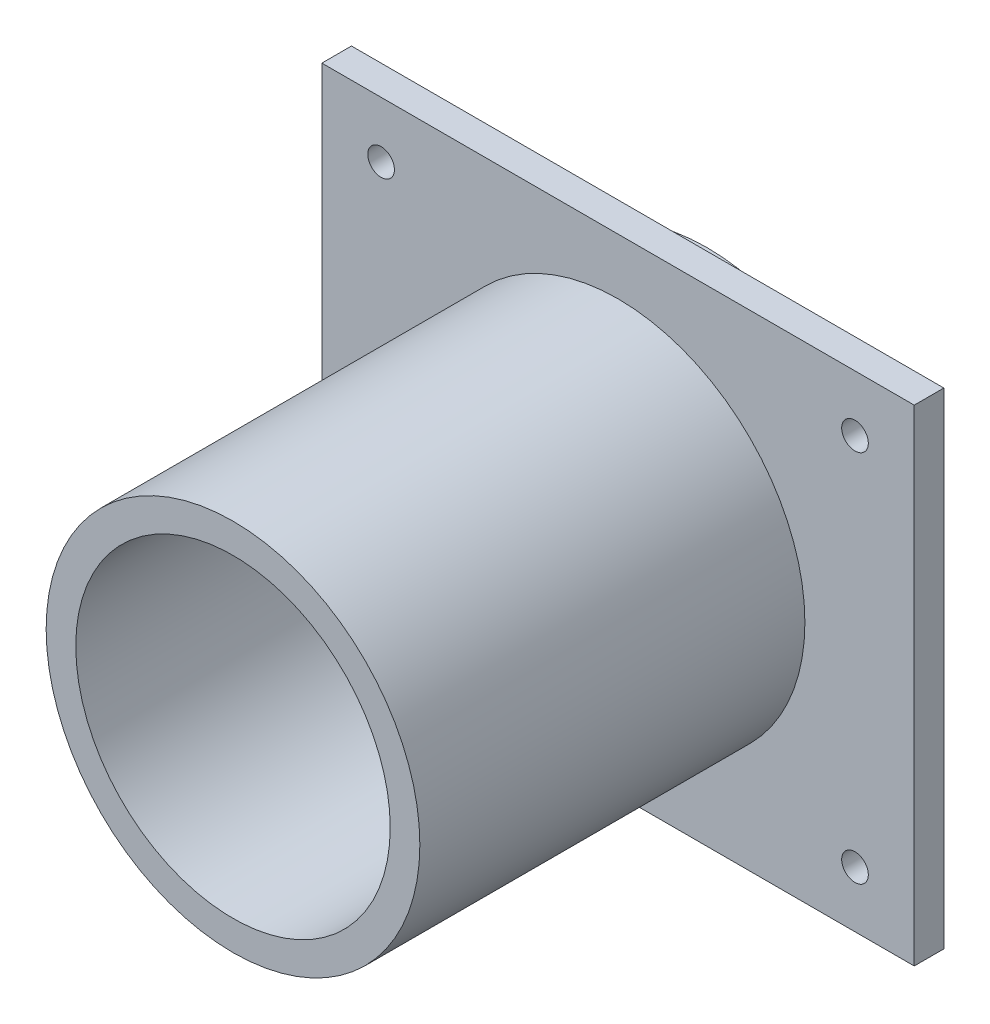
ISO-10303-21;
HEADER;
FILE_DESCRIPTION(('STEP AP214'),'2;1');
FILE_NAME('part.step','',(''),(''),'','','');
FILE_SCHEMA(('AUTOMOTIVE_DESIGN { 1 0 10303 214 1 1 1 1 }'));
ENDSEC;
DATA;
#1=APPLICATION_CONTEXT('core data for automotive mechanical design processes');
#2=APPLICATION_PROTOCOL_DEFINITION('international standard','automotive_design',2000,#1);
#3=PRODUCT_CONTEXT('',#1,'mechanical');
#4=PRODUCT('Part','Part','',(#3));
#5=PRODUCT_RELATED_PRODUCT_CATEGORY('part','',(#4));
#6=PRODUCT_DEFINITION_FORMATION('','',#4);
#7=PRODUCT_DEFINITION_CONTEXT('part definition',#1,'design');
#8=PRODUCT_DEFINITION('design','',#6,#7);
#9=PRODUCT_DEFINITION_SHAPE('','',#8);
#10=(LENGTH_UNIT() NAMED_UNIT(*) SI_UNIT(.MILLI.,.METRE.));
#11=(NAMED_UNIT(*) PLANE_ANGLE_UNIT() SI_UNIT($,.RADIAN.));
#12=(NAMED_UNIT(*) SI_UNIT($,.STERADIAN.) SOLID_ANGLE_UNIT());
#13=UNCERTAINTY_MEASURE_WITH_UNIT(LENGTH_MEASURE(1.E-05),#10,'distance_accuracy_value','');
#14=(GEOMETRIC_REPRESENTATION_CONTEXT(3) GLOBAL_UNCERTAINTY_ASSIGNED_CONTEXT((#13)) GLOBAL_UNIT_ASSIGNED_CONTEXT((#10,
#11,#12)) REPRESENTATION_CONTEXT('',''));
#15=CARTESIAN_POINT('',(0.,0.,0.));
#16=DIRECTION('',(0.,0.,1.));
#17=DIRECTION('',(1.,0.,0.));
#18=AXIS2_PLACEMENT_3D('',#15,#16,#17);
#19=CARTESIAN_POINT('',(0.,0.,-10.));
#20=DIRECTION('',(0.,0.,1.));
#21=DIRECTION('',(1.,0.,0.));
#22=AXIS2_PLACEMENT_3D('',#19,#20,#21);
#23=CYLINDRICAL_SURFACE('',#22,31.543);
#24=CARTESIAN_POINT('',(0.,0.,-10.));
#25=DIRECTION('',(0.,0.,1.));
#26=DIRECTION('',(1.,0.,0.));
#27=AXIS2_PLACEMENT_3D('',#24,#25,#26);
#28=CIRCLE('',#27,31.543);
#29=CARTESIAN_POINT('',(31.543,0.,-10.));
#30=VERTEX_POINT('',#29);
#31=EDGE_CURVE('E48',#30,#30,#28,.T.);
#32=ORIENTED_EDGE('',*,*,#31,.T.);
#33=EDGE_LOOP('',(#32));
#34=FACE_BOUND('',#33,.T.);
#35=CARTESIAN_POINT('',(0.,0.,0.));
#36=DIRECTION('',(0.,0.,1.));
#37=DIRECTION('',(1.,0.,0.));
#38=AXIS2_PLACEMENT_3D('',#35,#36,#37);
#39=CIRCLE('',#38,31.543);
#40=CARTESIAN_POINT('',(31.543,0.,0.));
#41=VERTEX_POINT('',#40);
#42=EDGE_CURVE('E133',#41,#41,#39,.T.);
#43=ORIENTED_EDGE('',*,*,#42,.F.);
#44=EDGE_LOOP('',(#43));
#45=FACE_BOUND('',#44,.T.);
#46=ADVANCED_FACE('F39',(#34,#45),#23,.T.);
#47=CARTESIAN_POINT('',(0.,0.,-10.));
#48=DIRECTION('',(0.,0.,1.));
#49=DIRECTION('',(1.,0.,0.));
#50=AXIS2_PLACEMENT_3D('',#47,#48,#49);
#51=PLANE('',#50);
#52=CARTESIAN_POINT('',(0.,0.,-10.));
#53=DIRECTION('',(0.,0.,1.));
#54=DIRECTION('',(1.,0.,0.));
#55=AXIS2_PLACEMENT_3D('',#52,#53,#54);
#56=CIRCLE('',#55,26.543);
#57=CARTESIAN_POINT('',(26.543,0.,-10.));
#58=VERTEX_POINT('',#57);
#59=EDGE_CURVE('E129',#58,#58,#56,.T.);
#60=ORIENTED_EDGE('',*,*,#59,.T.);
#61=EDGE_LOOP('',(#60));
#62=FACE_BOUND('',#61,.T.);
#63=ORIENTED_EDGE('',*,*,#31,.F.);
#64=EDGE_LOOP('',(#63));
#65=FACE_BOUND('',#64,.T.);
#66=ADVANCED_FACE('F147',(#62,#65),#51,.F.);
#67=CARTESIAN_POINT('',(0.,0.,-10.));
#68=DIRECTION('',(0.,0.,1.));
#69=DIRECTION('',(1.,0.,0.));
#70=AXIS2_PLACEMENT_3D('',#67,#68,#69);
#71=CYLINDRICAL_SURFACE('',#70,26.543);
#72=ORIENTED_EDGE('',*,*,#59,.F.);
#73=EDGE_LOOP('',(#72));
#74=FACE_BOUND('',#73,.T.);
#75=CARTESIAN_POINT('',(0.,0.,0.));
#76=DIRECTION('',(0.,0.,1.));
#77=DIRECTION('',(1.,0.,0.));
#78=AXIS2_PLACEMENT_3D('',#75,#76,#77);
#79=CIRCLE('',#78,26.543);
#80=CARTESIAN_POINT('',(26.543,0.,0.));
#81=VERTEX_POINT('',#80);
#82=EDGE_CURVE('E128',#81,#81,#79,.T.);
#83=ORIENTED_EDGE('',*,*,#82,.T.);
#84=EDGE_LOOP('',(#83));
#85=FACE_BOUND('',#84,.T.);
#86=ADVANCED_FACE('F152',(#74,#85),#71,.F.);
#87=CARTESIAN_POINT('',(0.,0.,0.));
#88=DIRECTION('',(0.,0.,-1.));
#89=DIRECTION('',(-1.,0.,0.));
#90=AXIS2_PLACEMENT_3D('',#87,#88,#89);
#91=PLANE('',#90);
#92=CARTESIAN_POINT('',(40.,31.543,0.));
#93=DIRECTION('',(0.,0.,-1.));
#94=DIRECTION('',(-1.,0.,0.));
#95=AXIS2_PLACEMENT_3D('',#92,#93,#94);
#96=CIRCLE('',#95,2.24999999999999);
#97=CARTESIAN_POINT('',(37.75,31.543,0.));
#98=VERTEX_POINT('',#97);
#99=EDGE_CURVE('E228',#98,#98,#96,.T.);
#100=ORIENTED_EDGE('',*,*,#99,.F.);
#101=EDGE_LOOP('',(#100));
#102=FACE_BOUND('',#101,.T.);
#103=CARTESIAN_POINT('',(-40.,31.543,0.));
#104=DIRECTION('',(0.,0.,-1.));
#105=DIRECTION('',(-1.,0.,0.));
#106=AXIS2_PLACEMENT_3D('',#103,#104,#105);
#107=CIRCLE('',#106,2.24999999999999);
#108=CARTESIAN_POINT('',(-42.25,31.543,0.));
#109=VERTEX_POINT('',#108);
#110=EDGE_CURVE('E236',#109,#109,#107,.T.);
#111=ORIENTED_EDGE('',*,*,#110,.F.);
#112=EDGE_LOOP('',(#111));
#113=FACE_BOUND('',#112,.T.);
#114=CARTESIAN_POINT('',(-40.,-31.543,0.));
#115=DIRECTION('',(0.,0.,-1.));
#116=DIRECTION('',(-1.,0.,0.));
#117=AXIS2_PLACEMENT_3D('',#114,#115,#116);
#118=CIRCLE('',#117,2.24999999999999);
#119=CARTESIAN_POINT('',(-42.25,-31.543,0.));
#120=VERTEX_POINT('',#119);
#121=EDGE_CURVE('E244',#120,#120,#118,.T.);
#122=ORIENTED_EDGE('',*,*,#121,.F.);
#123=EDGE_LOOP('',(#122));
#124=FACE_BOUND('',#123,.T.);
#125=CARTESIAN_POINT('',(40.,-31.543,0.));
#126=DIRECTION('',(0.,0.,-1.));
#127=DIRECTION('',(-1.,0.,0.));
#128=AXIS2_PLACEMENT_3D('',#125,#126,#127);
#129=CIRCLE('',#128,2.24999999999999);
#130=CARTESIAN_POINT('',(37.75,-31.543,0.));
#131=VERTEX_POINT('',#130);
#132=EDGE_CURVE('E252',#131,#131,#129,.T.);
#133=ORIENTED_EDGE('',*,*,#132,.F.);
#134=EDGE_LOOP('',(#133));
#135=FACE_BOUND('',#134,.T.);
#136=ORIENTED_EDGE('',*,*,#42,.T.);
#137=EDGE_LOOP('',(#136));
#138=FACE_BOUND('',#137,.T.);
#139=DIRECTION('',(0.,1.,0.));
#140=VECTOR('',#139,1.);
#141=CARTESIAN_POINT('',(50.,-41.,0.));
#142=LINE('',#141,#140);
#143=CARTESIAN_POINT('',(50.,-41.,0.));
#144=VERTEX_POINT('',#143);
#145=CARTESIAN_POINT('',(50.,41.,0.));
#146=VERTEX_POINT('',#145);
#147=EDGE_CURVE('E111',#144,#146,#142,.T.);
#148=ORIENTED_EDGE('',*,*,#147,.F.);
#149=DIRECTION('',(1.,0.,0.));
#150=VECTOR('',#149,1.);
#151=CARTESIAN_POINT('',(-50.,-41.,0.));
#152=LINE('',#151,#150);
#153=CARTESIAN_POINT('',(-50.,-41.,0.));
#154=VERTEX_POINT('',#153);
#155=EDGE_CURVE('E79',#154,#144,#152,.T.);
#156=ORIENTED_EDGE('',*,*,#155,.F.);
#157=DIRECTION('',(0.,-1.,0.));
#158=VECTOR('',#157,1.);
#159=CARTESIAN_POINT('',(-50.,-41.,0.));
#160=LINE('',#159,#158);
#161=CARTESIAN_POINT('',(-50.,41.,0.));
#162=VERTEX_POINT('',#161);
#163=EDGE_CURVE('E73',#162,#154,#160,.T.);
#164=ORIENTED_EDGE('',*,*,#163,.F.);
#165=DIRECTION('',(-1.,0.,0.));
#166=VECTOR('',#165,1.);
#167=CARTESIAN_POINT('',(-50.,41.,0.));
#168=LINE('',#167,#166);
#169=EDGE_CURVE('E98',#146,#162,#168,.T.);
#170=ORIENTED_EDGE('',*,*,#169,.F.);
#171=EDGE_LOOP('',(#148,#156,#164,#170));
#172=FACE_BOUND('',#171,.T.);
#173=ADVANCED_FACE('F143',(#102,#113,#124,#135,#138,#172),#91,.T.);
#174=CARTESIAN_POINT('',(0.,0.,5.));
#175=DIRECTION('',(0.,0.,-1.));
#176=DIRECTION('',(-1.,0.,0.));
#177=AXIS2_PLACEMENT_3D('',#174,#175,#176);
#178=PLANE('',#177);
#179=CARTESIAN_POINT('',(0.,0.,5.));
#180=DIRECTION('',(0.,0.,-1.));
#181=DIRECTION('',(-1.,0.,0.));
#182=AXIS2_PLACEMENT_3D('',#179,#180,#181);
#183=CIRCLE('',#182,31.543);
#184=CARTESIAN_POINT('',(-31.543,0.,5.));
#185=VERTEX_POINT('',#184);
#186=EDGE_CURVE('E11',#185,#185,#183,.F.);
#187=ORIENTED_EDGE('',*,*,#186,.F.);
#188=EDGE_LOOP('',(#187));
#189=FACE_BOUND('',#188,.T.);
#190=CARTESIAN_POINT('',(40.,31.543,5.));
#191=DIRECTION('',(0.,0.,-1.));
#192=DIRECTION('',(-1.,0.,0.));
#193=AXIS2_PLACEMENT_3D('',#190,#191,#192);
#194=CIRCLE('',#193,2.25);
#195=CARTESIAN_POINT('',(37.75,31.543,5.));
#196=VERTEX_POINT('',#195);
#197=EDGE_CURVE('E232',#196,#196,#194,.T.);
#198=ORIENTED_EDGE('',*,*,#197,.T.);
#199=EDGE_LOOP('',(#198));
#200=FACE_BOUND('',#199,.T.);
#201=CARTESIAN_POINT('',(-40.,31.543,5.));
#202=DIRECTION('',(0.,0.,-1.));
#203=DIRECTION('',(-1.,0.,0.));
#204=AXIS2_PLACEMENT_3D('',#201,#202,#203);
#205=CIRCLE('',#204,2.25);
#206=CARTESIAN_POINT('',(-42.25,31.543,5.));
#207=VERTEX_POINT('',#206);
#208=EDGE_CURVE('E240',#207,#207,#205,.T.);
#209=ORIENTED_EDGE('',*,*,#208,.T.);
#210=EDGE_LOOP('',(#209));
#211=FACE_BOUND('',#210,.T.);
#212=CARTESIAN_POINT('',(-40.,-31.543,5.));
#213=DIRECTION('',(0.,0.,-1.));
#214=DIRECTION('',(-1.,0.,0.));
#215=AXIS2_PLACEMENT_3D('',#212,#213,#214);
#216=CIRCLE('',#215,2.25);
#217=CARTESIAN_POINT('',(-42.25,-31.543,5.));
#218=VERTEX_POINT('',#217);
#219=EDGE_CURVE('E248',#218,#218,#216,.T.);
#220=ORIENTED_EDGE('',*,*,#219,.T.);
#221=EDGE_LOOP('',(#220));
#222=FACE_BOUND('',#221,.T.);
#223=CARTESIAN_POINT('',(40.,-31.543,5.));
#224=DIRECTION('',(0.,0.,-1.));
#225=DIRECTION('',(-1.,0.,0.));
#226=AXIS2_PLACEMENT_3D('',#223,#224,#225);
#227=CIRCLE('',#226,2.25);
#228=CARTESIAN_POINT('',(37.75,-31.543,5.));
#229=VERTEX_POINT('',#228);
#230=EDGE_CURVE('E115',#229,#229,#227,.T.);
#231=ORIENTED_EDGE('',*,*,#230,.T.);
#232=EDGE_LOOP('',(#231));
#233=FACE_BOUND('',#232,.T.);
#234=DIRECTION('',(0.,1.,0.));
#235=VECTOR('',#234,1.);
#236=CARTESIAN_POINT('',(50.,-41.,5.));
#237=LINE('',#236,#235);
#238=CARTESIAN_POINT('',(50.,-41.,5.));
#239=VERTEX_POINT('',#238);
#240=CARTESIAN_POINT('',(50.,41.,5.));
#241=VERTEX_POINT('',#240);
#242=EDGE_CURVE('E92',#239,#241,#237,.T.);
#243=ORIENTED_EDGE('',*,*,#242,.T.);
#244=DIRECTION('',(-1.,0.,0.));
#245=VECTOR('',#244,1.);
#246=CARTESIAN_POINT('',(-50.,41.,5.));
#247=LINE('',#246,#245);
#248=CARTESIAN_POINT('',(-50.,41.,5.));
#249=VERTEX_POINT('',#248);
#250=EDGE_CURVE('E87',#241,#249,#247,.T.);
#251=ORIENTED_EDGE('',*,*,#250,.T.);
#252=DIRECTION('',(0.,-1.,0.));
#253=VECTOR('',#252,1.);
#254=CARTESIAN_POINT('',(-50.,-41.,5.));
#255=LINE('',#254,#253);
#256=CARTESIAN_POINT('',(-50.,-41.,5.));
#257=VERTEX_POINT('',#256);
#258=EDGE_CURVE('E90',#249,#257,#255,.T.);
#259=ORIENTED_EDGE('',*,*,#258,.T.);
#260=DIRECTION('',(1.,0.,0.));
#261=VECTOR('',#260,1.);
#262=CARTESIAN_POINT('',(-50.,-41.,5.));
#263=LINE('',#262,#261);
#264=EDGE_CURVE('E56',#257,#239,#263,.T.);
#265=ORIENTED_EDGE('',*,*,#264,.T.);
#266=EDGE_LOOP('',(#243,#251,#259,#265));
#267=FACE_BOUND('',#266,.T.);
#268=ADVANCED_FACE('F88',(#189,#200,#211,#222,#233,#267),#178,.F.);
#269=CARTESIAN_POINT('',(-50.,-41.,5.));
#270=DIRECTION('',(0.,1.,0.));
#271=DIRECTION('',(0.,0.,1.));
#272=AXIS2_PLACEMENT_3D('',#269,#270,#271);
#273=PLANE('',#272);
#274=ORIENTED_EDGE('',*,*,#155,.T.);
#275=DIRECTION('',(0.,0.,-1.));
#276=VECTOR('',#275,1.);
#277=CARTESIAN_POINT('',(50.,-41.,5.));
#278=LINE('',#277,#276);
#279=EDGE_CURVE('E107',#239,#144,#278,.T.);
#280=ORIENTED_EDGE('',*,*,#279,.F.);
#281=ORIENTED_EDGE('',*,*,#264,.F.);
#282=DIRECTION('',(0.,0.,-1.));
#283=VECTOR('',#282,1.);
#284=CARTESIAN_POINT('',(-50.,-41.,5.));
#285=LINE('',#284,#283);
#286=EDGE_CURVE('E101',#257,#154,#285,.T.);
#287=ORIENTED_EDGE('',*,*,#286,.T.);
#288=EDGE_LOOP('',(#274,#280,#281,#287));
#289=FACE_BOUND('',#288,.T.);
#290=ADVANCED_FACE('F171',(#289),#273,.F.);
#291=CARTESIAN_POINT('',(-50.,-41.,5.));
#292=DIRECTION('',(1.,0.,0.));
#293=DIRECTION('',(0.,0.,-1.));
#294=AXIS2_PLACEMENT_3D('',#291,#292,#293);
#295=PLANE('',#294);
#296=ORIENTED_EDGE('',*,*,#163,.T.);
#297=ORIENTED_EDGE('',*,*,#286,.F.);
#298=ORIENTED_EDGE('',*,*,#258,.F.);
#299=DIRECTION('',(0.,0.,-1.));
#300=VECTOR('',#299,1.);
#301=CARTESIAN_POINT('',(-50.,41.,5.));
#302=LINE('',#301,#300);
#303=EDGE_CURVE('E96',#249,#162,#302,.T.);
#304=ORIENTED_EDGE('',*,*,#303,.T.);
#305=EDGE_LOOP('',(#296,#297,#298,#304));
#306=FACE_BOUND('',#305,.T.);
#307=ADVANCED_FACE('F103',(#306),#295,.F.);
#308=CARTESIAN_POINT('',(-50.,41.,5.));
#309=DIRECTION('',(0.,-1.,0.));
#310=DIRECTION('',(0.,0.,-1.));
#311=AXIS2_PLACEMENT_3D('',#308,#309,#310);
#312=PLANE('',#311);
#313=ORIENTED_EDGE('',*,*,#169,.T.);
#314=ORIENTED_EDGE('',*,*,#303,.F.);
#315=ORIENTED_EDGE('',*,*,#250,.F.);
#316=DIRECTION('',(0.,0.,-1.));
#317=VECTOR('',#316,1.);
#318=CARTESIAN_POINT('',(50.,41.,5.));
#319=LINE('',#318,#317);
#320=EDGE_CURVE('E100',#241,#146,#319,.T.);
#321=ORIENTED_EDGE('',*,*,#320,.T.);
#322=EDGE_LOOP('',(#313,#314,#315,#321));
#323=FACE_BOUND('',#322,.T.);
#324=ADVANCED_FACE('F97',(#323),#312,.F.);
#325=CARTESIAN_POINT('',(50.,-41.,5.));
#326=DIRECTION('',(-1.,0.,0.));
#327=DIRECTION('',(0.,0.,1.));
#328=AXIS2_PLACEMENT_3D('',#325,#326,#327);
#329=PLANE('',#328);
#330=ORIENTED_EDGE('',*,*,#147,.T.);
#331=ORIENTED_EDGE('',*,*,#320,.F.);
#332=ORIENTED_EDGE('',*,*,#242,.F.);
#333=ORIENTED_EDGE('',*,*,#279,.T.);
#334=EDGE_LOOP('',(#330,#331,#332,#333));
#335=FACE_BOUND('',#334,.T.);
#336=ADVANCED_FACE('F162',(#335),#329,.F.);
#337=ORIENTED_EDGE('',*,*,#82,.F.);
#338=EDGE_LOOP('',(#337));
#339=FACE_BOUND('',#338,.T.);
#340=ADVANCED_FACE('F165',(#339),#91,.T.);
#341=CARTESIAN_POINT('',(40.,-31.543,0.));
#342=DIRECTION('',(0.,0.,-1.));
#343=DIRECTION('',(-1.,0.,0.));
#344=AXIS2_PLACEMENT_3D('',#341,#342,#343);
#345=CYLINDRICAL_SURFACE('',#344,2.25);
#346=ORIENTED_EDGE('',*,*,#230,.F.);
#347=EDGE_LOOP('',(#346));
#348=FACE_BOUND('',#347,.T.);
#349=ORIENTED_EDGE('',*,*,#132,.T.);
#350=EDGE_LOOP('',(#349));
#351=FACE_BOUND('',#350,.T.);
#352=ADVANCED_FACE('F181',(#348,#351),#345,.F.);
#353=CARTESIAN_POINT('',(-40.,-31.543,0.));
#354=DIRECTION('',(0.,0.,-1.));
#355=DIRECTION('',(-1.,0.,0.));
#356=AXIS2_PLACEMENT_3D('',#353,#354,#355);
#357=CYLINDRICAL_SURFACE('',#356,2.25);
#358=ORIENTED_EDGE('',*,*,#219,.F.);
#359=EDGE_LOOP('',(#358));
#360=FACE_BOUND('',#359,.T.);
#361=ORIENTED_EDGE('',*,*,#121,.T.);
#362=EDGE_LOOP('',(#361));
#363=FACE_BOUND('',#362,.T.);
#364=ADVANCED_FACE('F184',(#360,#363),#357,.F.);
#365=CARTESIAN_POINT('',(-40.,31.543,0.));
#366=DIRECTION('',(0.,0.,-1.));
#367=DIRECTION('',(-1.,0.,0.));
#368=AXIS2_PLACEMENT_3D('',#365,#366,#367);
#369=CYLINDRICAL_SURFACE('',#368,2.25);
#370=ORIENTED_EDGE('',*,*,#208,.F.);
#371=EDGE_LOOP('',(#370));
#372=FACE_BOUND('',#371,.T.);
#373=ORIENTED_EDGE('',*,*,#110,.T.);
#374=EDGE_LOOP('',(#373));
#375=FACE_BOUND('',#374,.T.);
#376=ADVANCED_FACE('F188',(#372,#375),#369,.F.);
#377=CARTESIAN_POINT('',(40.,31.543,0.));
#378=DIRECTION('',(0.,0.,-1.));
#379=DIRECTION('',(-1.,0.,0.));
#380=AXIS2_PLACEMENT_3D('',#377,#378,#379);
#381=CYLINDRICAL_SURFACE('',#380,2.25);
#382=ORIENTED_EDGE('',*,*,#197,.F.);
#383=EDGE_LOOP('',(#382));
#384=FACE_BOUND('',#383,.T.);
#385=ORIENTED_EDGE('',*,*,#99,.T.);
#386=EDGE_LOOP('',(#385));
#387=FACE_BOUND('',#386,.T.);
#388=ADVANCED_FACE('F192',(#384,#387),#381,.F.);
#389=CARTESIAN_POINT('',(0.,0.,70.));
#390=DIRECTION('',(0.,0.,1.));
#391=DIRECTION('',(1.,0.,0.));
#392=AXIS2_PLACEMENT_3D('',#389,#390,#391);
#393=PLANE('',#392);
#394=CARTESIAN_POINT('',(0.,0.,70.));
#395=DIRECTION('',(0.,0.,1.));
#396=DIRECTION('',(1.,0.,0.));
#397=AXIS2_PLACEMENT_3D('',#394,#395,#396);
#398=CIRCLE('',#397,31.543);
#399=CARTESIAN_POINT('',(31.543,0.,70.));
#400=VERTEX_POINT('',#399);
#401=EDGE_CURVE('E222',#400,#400,#398,.T.);
#402=ORIENTED_EDGE('',*,*,#401,.T.);
#403=EDGE_LOOP('',(#402));
#404=FACE_BOUND('',#403,.T.);
#405=CARTESIAN_POINT('',(0.,0.,70.));
#406=DIRECTION('',(0.,0.,1.));
#407=DIRECTION('',(1.,0.,0.));
#408=AXIS2_PLACEMENT_3D('',#405,#406,#407);
#409=CIRCLE('',#408,26.543);
#410=CARTESIAN_POINT('',(26.543,0.,70.));
#411=VERTEX_POINT('',#410);
#412=EDGE_CURVE('E215',#411,#411,#409,.T.);
#413=ORIENTED_EDGE('',*,*,#412,.F.);
#414=EDGE_LOOP('',(#413));
#415=FACE_BOUND('',#414,.T.);
#416=ADVANCED_FACE('F196',(#404,#415),#393,.T.);
#417=CARTESIAN_POINT('',(0.,0.,70.));
#418=DIRECTION('',(0.,0.,-1.));
#419=DIRECTION('',(-1.,0.,0.));
#420=AXIS2_PLACEMENT_3D('',#417,#418,#419);
#421=CYLINDRICAL_SURFACE('',#420,31.543);
#422=ORIENTED_EDGE('',*,*,#401,.F.);
#423=EDGE_LOOP('',(#422));
#424=FACE_BOUND('',#423,.T.);
#425=ORIENTED_EDGE('',*,*,#186,.T.);
#426=EDGE_LOOP('',(#425));
#427=FACE_BOUND('',#426,.T.);
#428=ADVANCED_FACE('F198',(#424,#427),#421,.T.);
#429=CARTESIAN_POINT('',(0.,0.,70.));
#430=DIRECTION('',(0.,0.,-1.));
#431=DIRECTION('',(-1.,0.,0.));
#432=AXIS2_PLACEMENT_3D('',#429,#430,#431);
#433=CYLINDRICAL_SURFACE('',#432,26.543);
#434=ORIENTED_EDGE('',*,*,#412,.T.);
#435=EDGE_LOOP('',(#434));
#436=FACE_BOUND('',#435,.T.);
#437=CARTESIAN_POINT('',(0.,0.,5.));
#438=DIRECTION('',(0.,0.,1.));
#439=DIRECTION('',(1.,0.,0.));
#440=AXIS2_PLACEMENT_3D('',#437,#438,#439);
#441=CIRCLE('',#440,26.543);
#442=CARTESIAN_POINT('',(26.543,0.,5.));
#443=VERTEX_POINT('',#442);
#444=EDGE_CURVE('E218',#443,#443,#441,.T.);
#445=ORIENTED_EDGE('',*,*,#444,.F.);
#446=EDGE_LOOP('',(#445));
#447=FACE_BOUND('',#446,.T.);
#448=ADVANCED_FACE('F201',(#436,#447),#433,.F.);
#449=ORIENTED_EDGE('',*,*,#444,.T.);
#450=EDGE_LOOP('',(#449));
#451=FACE_BOUND('',#450,.T.);
#452=ADVANCED_FACE('F180',(#451),#178,.F.);
#453=CLOSED_SHELL('',(#46,#66,#86,#173,#268,#290,#307,#324,#336,#340,#352,#364,#376,#388,#416,
#428,#448,#452));
#454=MANIFOLD_SOLID_BREP('B2',#453);
#455=ADVANCED_BREP_SHAPE_REPRESENTATION('',(#18,#454),#14);
#456=SHAPE_DEFINITION_REPRESENTATION(#9,#455);
ENDSEC;
END-ISO-10303-21;
